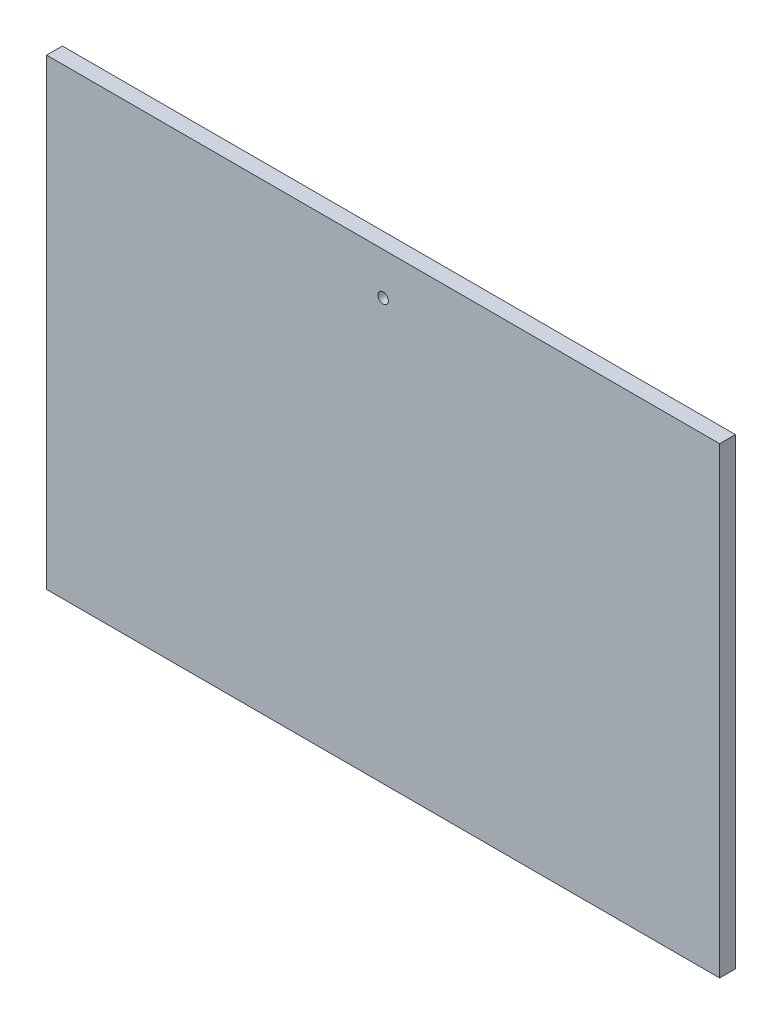
ISO-10303-21;
HEADER;
FILE_DESCRIPTION(('STEP AP214'),'2;1');
FILE_NAME('part.step','',(''),(''),'','','');
FILE_SCHEMA(('AUTOMOTIVE_DESIGN { 1 0 10303 214 1 1 1 1 }'));
ENDSEC;
DATA;
#1=APPLICATION_CONTEXT('core data for automotive mechanical design processes');
#2=APPLICATION_PROTOCOL_DEFINITION('international standard','automotive_design',2000,#1);
#3=PRODUCT_CONTEXT('',#1,'mechanical');
#4=PRODUCT('Part','Part','',(#3));
#5=PRODUCT_RELATED_PRODUCT_CATEGORY('part','',(#4));
#6=PRODUCT_DEFINITION_FORMATION('','',#4);
#7=PRODUCT_DEFINITION_CONTEXT('part definition',#1,'design');
#8=PRODUCT_DEFINITION('design','',#6,#7);
#9=PRODUCT_DEFINITION_SHAPE('','',#8);
#10=(LENGTH_UNIT() NAMED_UNIT(*) SI_UNIT(.MILLI.,.METRE.));
#11=(NAMED_UNIT(*) PLANE_ANGLE_UNIT() SI_UNIT($,.RADIAN.));
#12=(NAMED_UNIT(*) SI_UNIT($,.STERADIAN.) SOLID_ANGLE_UNIT());
#13=UNCERTAINTY_MEASURE_WITH_UNIT(LENGTH_MEASURE(1.E-05),#10,'distance_accuracy_value','');
#14=(GEOMETRIC_REPRESENTATION_CONTEXT(3) GLOBAL_UNCERTAINTY_ASSIGNED_CONTEXT((#13)) GLOBAL_UNIT_ASSIGNED_CONTEXT((#10,
#11,#12)) REPRESENTATION_CONTEXT('',''));
#15=CARTESIAN_POINT('',(0.,0.,0.));
#16=DIRECTION('',(0.,0.,1.));
#17=DIRECTION('',(1.,0.,0.));
#18=AXIS2_PLACEMENT_3D('',#15,#16,#17);
#19=CARTESIAN_POINT('',(0.,0.,1.5));
#20=DIRECTION('',(0.,0.,-1.));
#21=DIRECTION('',(-1.,0.,0.));
#22=AXIS2_PLACEMENT_3D('',#19,#20,#21);
#23=PLANE('',#22);
#24=DIRECTION('',(0.,-1.,0.));
#25=VECTOR('',#24,1.);
#26=CARTESIAN_POINT('',(-59.2181548092737,-11.0672131147541,1.5));
#27=LINE('',#26,#25);
#28=CARTESIAN_POINT('',(-59.2181548092737,35.9327868852459,1.5));
#29=VERTEX_POINT('',#28);
#30=CARTESIAN_POINT('',(-59.2181548092737,-8.06721311475408,1.5));
#31=VERTEX_POINT('',#30);
#32=EDGE_CURVE('E44',#29,#31,#27,.T.);
#33=ORIENTED_EDGE('',*,*,#32,.T.);
#34=DIRECTION('',(-1.,0.,0.));
#35=VECTOR('',#34,1.);
#36=CARTESIAN_POINT('',(-59.2181548092737,-8.06721311475408,1.5));
#37=LINE('',#36,#35);
#38=CARTESIAN_POINT('',(4.78184519072626,-8.06721311475408,1.5));
#39=VERTEX_POINT('',#38);
#40=EDGE_CURVE('E78',#39,#31,#37,.T.);
#41=ORIENTED_EDGE('',*,*,#40,.F.);
#42=DIRECTION('',(0.,1.,0.));
#43=VECTOR('',#42,1.);
#44=CARTESIAN_POINT('',(4.78184519072626,38.9327868852459,1.5));
#45=LINE('',#44,#43);
#46=CARTESIAN_POINT('',(4.78184519072626,35.9327868852459,1.5));
#47=VERTEX_POINT('',#46);
#48=EDGE_CURVE('E11',#39,#47,#45,.T.);
#49=ORIENTED_EDGE('',*,*,#48,.T.);
#50=DIRECTION('',(1.,0.,0.));
#51=VECTOR('',#50,1.);
#52=CARTESIAN_POINT('',(-59.2181548092737,35.9327868852459,1.5));
#53=LINE('',#52,#51);
#54=EDGE_CURVE('E52',#29,#47,#53,.T.);
#55=ORIENTED_EDGE('',*,*,#54,.F.);
#56=EDGE_LOOP('',(#33,#41,#49,#55));
#57=FACE_BOUND('',#56,.T.);
#58=CARTESIAN_POINT('',(-27.2181548092737,31.9327868852459,1.5));
#59=DIRECTION('',(0.,0.,1.));
#60=DIRECTION('',(1.,0.,0.));
#61=AXIS2_PLACEMENT_3D('',#58,#59,#60);
#62=CIRCLE('',#61,0.499999999999999);
#63=CARTESIAN_POINT('',(-26.7181548092737,31.9327868852459,1.5));
#64=VERTEX_POINT('',#63);
#65=EDGE_CURVE('E101',#64,#64,#62,.T.);
#66=ORIENTED_EDGE('',*,*,#65,.F.);
#67=EDGE_LOOP('',(#66));
#68=FACE_BOUND('',#67,.T.);
#69=ADVANCED_FACE('F35',(#57,#68),#23,.F.);
#70=CARTESIAN_POINT('',(0.,0.,0.));
#71=DIRECTION('',(0.,0.,-1.));
#72=DIRECTION('',(-1.,0.,0.));
#73=AXIS2_PLACEMENT_3D('',#70,#71,#72);
#74=PLANE('',#73);
#75=DIRECTION('',(-1.,0.,0.));
#76=VECTOR('',#75,1.);
#77=CARTESIAN_POINT('',(-59.2181548092737,-8.06721311475408,0.));
#78=LINE('',#77,#76);
#79=CARTESIAN_POINT('',(4.78184519072626,-8.06721311475408,0.));
#80=VERTEX_POINT('',#79);
#81=CARTESIAN_POINT('',(-59.2181548092737,-8.06721311475408,0.));
#82=VERTEX_POINT('',#81);
#83=EDGE_CURVE('E60',#80,#82,#78,.T.);
#84=ORIENTED_EDGE('',*,*,#83,.T.);
#85=DIRECTION('',(0.,-1.,0.));
#86=VECTOR('',#85,1.);
#87=CARTESIAN_POINT('',(-59.2181548092737,-11.0672131147541,0.));
#88=LINE('',#87,#86);
#89=CARTESIAN_POINT('',(-59.2181548092737,35.9327868852459,0.));
#90=VERTEX_POINT('',#89);
#91=EDGE_CURVE('E104',#90,#82,#88,.T.);
#92=ORIENTED_EDGE('',*,*,#91,.F.);
#93=DIRECTION('',(1.,0.,0.));
#94=VECTOR('',#93,1.);
#95=CARTESIAN_POINT('',(-59.2181548092737,35.9327868852459,0.));
#96=LINE('',#95,#94);
#97=CARTESIAN_POINT('',(4.78184519072626,35.9327868852459,0.));
#98=VERTEX_POINT('',#97);
#99=EDGE_CURVE('E96',#90,#98,#96,.T.);
#100=ORIENTED_EDGE('',*,*,#99,.T.);
#101=DIRECTION('',(0.,1.,0.));
#102=VECTOR('',#101,1.);
#103=CARTESIAN_POINT('',(4.78184519072626,38.9327868852459,0.));
#104=LINE('',#103,#102);
#105=EDGE_CURVE('E39',#80,#98,#104,.T.);
#106=ORIENTED_EDGE('',*,*,#105,.F.);
#107=EDGE_LOOP('',(#84,#92,#100,#106));
#108=FACE_BOUND('',#107,.T.);
#109=CARTESIAN_POINT('',(-27.2181548092737,31.9327868852459,0.));
#110=DIRECTION('',(0.,0.,1.));
#111=DIRECTION('',(1.,0.,0.));
#112=AXIS2_PLACEMENT_3D('',#109,#110,#111);
#113=CIRCLE('',#112,0.499999999999999);
#114=CARTESIAN_POINT('',(-26.7181548092737,31.9327868852459,0.));
#115=VERTEX_POINT('',#114);
#116=EDGE_CURVE('E105',#115,#115,#113,.T.);
#117=ORIENTED_EDGE('',*,*,#116,.T.);
#118=EDGE_LOOP('',(#117));
#119=FACE_BOUND('',#118,.T.);
#120=ADVANCED_FACE('F113',(#108,#119),#74,.T.);
#121=CARTESIAN_POINT('',(-59.2181548092737,-11.0672131147541,1.5));
#122=DIRECTION('',(1.,0.,0.));
#123=DIRECTION('',(0.,0.,-1.));
#124=AXIS2_PLACEMENT_3D('',#121,#122,#123);
#125=PLANE('',#124);
#126=ORIENTED_EDGE('',*,*,#91,.T.);
#127=DIRECTION('',(0.,0.,1.));
#128=VECTOR('',#127,1.);
#129=CARTESIAN_POINT('',(-59.2181548092737,-8.06721311475408,0.));
#130=LINE('',#129,#128);
#131=EDGE_CURVE('E84',#82,#31,#130,.T.);
#132=ORIENTED_EDGE('',*,*,#131,.T.);
#133=ORIENTED_EDGE('',*,*,#32,.F.);
#134=DIRECTION('',(0.,0.,1.));
#135=VECTOR('',#134,1.);
#136=CARTESIAN_POINT('',(-59.2181548092737,35.9327868852459,0.));
#137=LINE('',#136,#135);
#138=EDGE_CURVE('E94',#90,#29,#137,.T.);
#139=ORIENTED_EDGE('',*,*,#138,.F.);
#140=EDGE_LOOP('',(#126,#132,#133,#139));
#141=FACE_BOUND('',#140,.T.);
#142=ADVANCED_FACE('F37',(#141),#125,.F.);
#143=CARTESIAN_POINT('',(4.78184519072626,38.9327868852459,1.5));
#144=DIRECTION('',(-1.,0.,0.));
#145=DIRECTION('',(0.,0.,1.));
#146=AXIS2_PLACEMENT_3D('',#143,#144,#145);
#147=PLANE('',#146);
#148=ORIENTED_EDGE('',*,*,#48,.F.);
#149=DIRECTION('',(0.,0.,1.));
#150=VECTOR('',#149,1.);
#151=CARTESIAN_POINT('',(4.78184519072626,-8.06721311475408,0.));
#152=LINE('',#151,#150);
#153=EDGE_CURVE('E75',#80,#39,#152,.T.);
#154=ORIENTED_EDGE('',*,*,#153,.F.);
#155=ORIENTED_EDGE('',*,*,#105,.T.);
#156=DIRECTION('',(0.,0.,1.));
#157=VECTOR('',#156,1.);
#158=CARTESIAN_POINT('',(4.78184519072626,35.9327868852459,0.));
#159=LINE('',#158,#157);
#160=EDGE_CURVE('E90',#98,#47,#159,.T.);
#161=ORIENTED_EDGE('',*,*,#160,.T.);
#162=EDGE_LOOP('',(#148,#154,#155,#161));
#163=FACE_BOUND('',#162,.T.);
#164=ADVANCED_FACE('F92',(#163),#147,.F.);
#165=CARTESIAN_POINT('',(-27.2181548092737,31.9327868852459,1.5));
#166=DIRECTION('',(0.,0.,-1.));
#167=DIRECTION('',(-1.,0.,0.));
#168=AXIS2_PLACEMENT_3D('',#165,#166,#167);
#169=CYLINDRICAL_SURFACE('',#168,0.499999999999999);
#170=ORIENTED_EDGE('',*,*,#65,.T.);
#171=EDGE_LOOP('',(#170));
#172=FACE_BOUND('',#171,.T.);
#173=ORIENTED_EDGE('',*,*,#116,.F.);
#174=EDGE_LOOP('',(#173));
#175=FACE_BOUND('',#174,.T.);
#176=ADVANCED_FACE('F119',(#172,#175),#169,.F.);
#177=CARTESIAN_POINT('',(-59.2181548092737,35.9327868852459,0.));
#178=DIRECTION('',(0.,-1.,0.));
#179=DIRECTION('',(0.,0.,-1.));
#180=AXIS2_PLACEMENT_3D('',#177,#178,#179);
#181=PLANE('',#180);
#182=ORIENTED_EDGE('',*,*,#54,.T.);
#183=ORIENTED_EDGE('',*,*,#160,.F.);
#184=ORIENTED_EDGE('',*,*,#99,.F.);
#185=ORIENTED_EDGE('',*,*,#138,.T.);
#186=EDGE_LOOP('',(#182,#183,#184,#185));
#187=FACE_BOUND('',#186,.T.);
#188=ADVANCED_FACE('F117',(#187),#181,.F.);
#189=CARTESIAN_POINT('',(-59.2181548092737,-8.06721311475408,0.));
#190=DIRECTION('',(0.,1.,0.));
#191=DIRECTION('',(0.,0.,1.));
#192=AXIS2_PLACEMENT_3D('',#189,#190,#191);
#193=PLANE('',#192);
#194=ORIENTED_EDGE('',*,*,#40,.T.);
#195=ORIENTED_EDGE('',*,*,#131,.F.);
#196=ORIENTED_EDGE('',*,*,#83,.F.);
#197=ORIENTED_EDGE('',*,*,#153,.T.);
#198=EDGE_LOOP('',(#194,#195,#196,#197));
#199=FACE_BOUND('',#198,.T.);
#200=ADVANCED_FACE('F77',(#199),#193,.F.);
#201=CLOSED_SHELL('',(#69,#120,#142,#164,#176,#188,#200));
#202=MANIFOLD_SOLID_BREP('B2',#201);
#203=ADVANCED_BREP_SHAPE_REPRESENTATION('',(#18,#202),#14);
#204=SHAPE_DEFINITION_REPRESENTATION(#9,#203);
ENDSEC;
END-ISO-10303-21;
